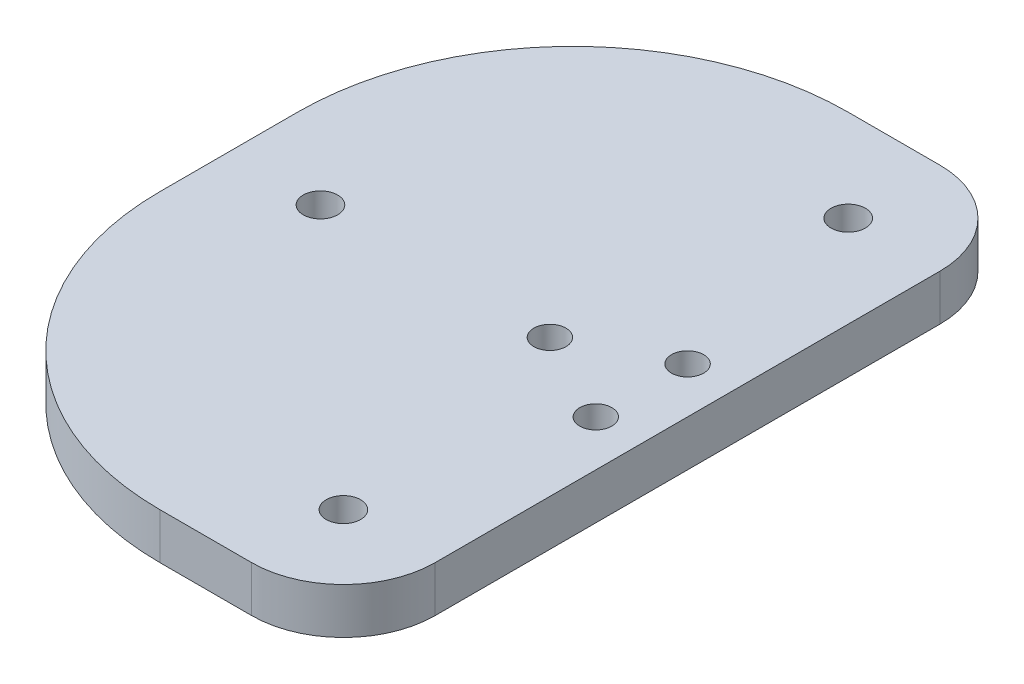
ISO-10303-21;
HEADER;
FILE_DESCRIPTION(('STEP AP214'),'2;1');
FILE_NAME('part.step','',(''),(''),'','','');
FILE_SCHEMA(('AUTOMOTIVE_DESIGN { 1 0 10303 214 1 1 1 1 }'));
ENDSEC;
DATA;
#1=APPLICATION_CONTEXT('core data for automotive mechanical design processes');
#2=APPLICATION_PROTOCOL_DEFINITION('international standard','automotive_design',2000,#1);
#3=PRODUCT_CONTEXT('',#1,'mechanical');
#4=PRODUCT('Part','Part','',(#3));
#5=PRODUCT_RELATED_PRODUCT_CATEGORY('part','',(#4));
#6=PRODUCT_DEFINITION_FORMATION('','',#4);
#7=PRODUCT_DEFINITION_CONTEXT('part definition',#1,'design');
#8=PRODUCT_DEFINITION('design','',#6,#7);
#9=PRODUCT_DEFINITION_SHAPE('','',#8);
#10=(LENGTH_UNIT() NAMED_UNIT(*) SI_UNIT(.MILLI.,.METRE.));
#11=(NAMED_UNIT(*) PLANE_ANGLE_UNIT() SI_UNIT($,.RADIAN.));
#12=(NAMED_UNIT(*) SI_UNIT($,.STERADIAN.) SOLID_ANGLE_UNIT());
#13=UNCERTAINTY_MEASURE_WITH_UNIT(LENGTH_MEASURE(1.E-05),#10,'distance_accuracy_value','');
#14=(GEOMETRIC_REPRESENTATION_CONTEXT(3) GLOBAL_UNCERTAINTY_ASSIGNED_CONTEXT((#13)) GLOBAL_UNIT_ASSIGNED_CONTEXT((#10,
#11,#12)) REPRESENTATION_CONTEXT('',''));
#15=CARTESIAN_POINT('',(0.,0.,0.));
#16=DIRECTION('',(0.,0.,1.));
#17=DIRECTION('',(1.,0.,0.));
#18=AXIS2_PLACEMENT_3D('',#15,#16,#17);
#19=CARTESIAN_POINT('',(45.,5.,-32.5));
#20=DIRECTION('',(0.,-1.,0.));
#21=DIRECTION('',(0.,0.,-1.));
#22=AXIS2_PLACEMENT_3D('',#19,#20,#21);
#23=CYLINDRICAL_SURFACE('',#22,1.75);
#24=CARTESIAN_POINT('',(45.,5.,-32.5));
#25=DIRECTION('',(0.,1.,0.));
#26=DIRECTION('',(0.,0.,1.));
#27=AXIS2_PLACEMENT_3D('',#24,#25,#26);
#28=CIRCLE('',#27,1.75);
#29=CARTESIAN_POINT('',(45.,5.,-30.75));
#30=VERTEX_POINT('',#29);
#31=EDGE_CURVE('E215',#30,#30,#28,.T.);
#32=ORIENTED_EDGE('',*,*,#31,.T.);
#33=EDGE_LOOP('',(#32));
#34=FACE_BOUND('',#33,.T.);
#35=CARTESIAN_POINT('',(45.,2.5,-32.5));
#36=DIRECTION('',(0.,-1.,0.));
#37=DIRECTION('',(0.,0.,-1.));
#38=AXIS2_PLACEMENT_3D('',#35,#36,#37);
#39=CIRCLE('',#38,1.75);
#40=CARTESIAN_POINT('',(45.,2.5,-34.25));
#41=VERTEX_POINT('',#40);
#42=EDGE_CURVE('E152',#41,#41,#39,.T.);
#43=ORIENTED_EDGE('',*,*,#42,.T.);
#44=EDGE_LOOP('',(#43));
#45=FACE_BOUND('',#44,.T.);
#46=ADVANCED_FACE('F37',(#34,#45),#23,.F.);
#47=CARTESIAN_POINT('',(35.,5.,-37.5));
#48=DIRECTION('',(0.,-1.,0.));
#49=DIRECTION('',(0.,0.,-1.));
#50=AXIS2_PLACEMENT_3D('',#47,#48,#49);
#51=CYLINDRICAL_SURFACE('',#50,1.75);
#52=CARTESIAN_POINT('',(35.,5.,-37.5));
#53=DIRECTION('',(0.,1.,0.));
#54=DIRECTION('',(0.,0.,1.));
#55=AXIS2_PLACEMENT_3D('',#52,#53,#54);
#56=CIRCLE('',#55,1.75);
#57=CARTESIAN_POINT('',(35.,5.,-35.75));
#58=VERTEX_POINT('',#57);
#59=EDGE_CURVE('E220',#58,#58,#56,.T.);
#60=ORIENTED_EDGE('',*,*,#59,.T.);
#61=EDGE_LOOP('',(#60));
#62=FACE_BOUND('',#61,.T.);
#63=CARTESIAN_POINT('',(35.,2.5,-37.5));
#64=DIRECTION('',(0.,-1.,0.));
#65=DIRECTION('',(0.,0.,-1.));
#66=AXIS2_PLACEMENT_3D('',#63,#64,#65);
#67=CIRCLE('',#66,1.75);
#68=CARTESIAN_POINT('',(35.,2.5,-39.25));
#69=VERTEX_POINT('',#68);
#70=EDGE_CURVE('E148',#69,#69,#67,.T.);
#71=ORIENTED_EDGE('',*,*,#70,.T.);
#72=EDGE_LOOP('',(#71));
#73=FACE_BOUND('',#72,.T.);
#74=ADVANCED_FACE('F270',(#62,#73),#51,.F.);
#75=CARTESIAN_POINT('',(45.,5.,-42.5));
#76=DIRECTION('',(0.,-1.,0.));
#77=DIRECTION('',(0.,0.,-1.));
#78=AXIS2_PLACEMENT_3D('',#75,#76,#77);
#79=CYLINDRICAL_SURFACE('',#78,1.75);
#80=CARTESIAN_POINT('',(45.,5.,-42.5));
#81=DIRECTION('',(0.,1.,0.));
#82=DIRECTION('',(0.,0.,1.));
#83=AXIS2_PLACEMENT_3D('',#80,#81,#82);
#84=CIRCLE('',#83,1.75);
#85=CARTESIAN_POINT('',(45.,5.,-40.75));
#86=VERTEX_POINT('',#85);
#87=EDGE_CURVE('E155',#86,#86,#84,.T.);
#88=ORIENTED_EDGE('',*,*,#87,.T.);
#89=EDGE_LOOP('',(#88));
#90=FACE_BOUND('',#89,.T.);
#91=CARTESIAN_POINT('',(45.,2.5,-42.5));
#92=DIRECTION('',(0.,-1.,0.));
#93=DIRECTION('',(0.,0.,-1.));
#94=AXIS2_PLACEMENT_3D('',#91,#92,#93);
#95=CIRCLE('',#94,1.75);
#96=CARTESIAN_POINT('',(45.,2.5,-44.25));
#97=VERTEX_POINT('',#96);
#98=EDGE_CURVE('E145',#97,#97,#95,.T.);
#99=ORIENTED_EDGE('',*,*,#98,.T.);
#100=EDGE_LOOP('',(#99));
#101=FACE_BOUND('',#100,.T.);
#102=ADVANCED_FACE('F276',(#90,#101),#79,.F.);
#103=CARTESIAN_POINT('',(0.,5.,0.));
#104=DIRECTION('',(0.,-1.,0.));
#105=DIRECTION('',(0.,0.,-1.));
#106=AXIS2_PLACEMENT_3D('',#103,#104,#105);
#107=PLANE('',#106);
#108=DIRECTION('',(0.,0.,-1.));
#109=VECTOR('',#108,1.);
#110=CARTESIAN_POINT('',(50.,5.,0.));
#111=LINE('',#110,#109);
#112=CARTESIAN_POINT('',(50.,5.,-10.));
#113=VERTEX_POINT('',#112);
#114=CARTESIAN_POINT('',(50.,5.,-65.));
#115=VERTEX_POINT('',#114);
#116=EDGE_CURVE('E183',#113,#115,#111,.T.);
#117=ORIENTED_EDGE('',*,*,#116,.T.);
#118=CARTESIAN_POINT('',(40.,5.,-65.));
#119=DIRECTION('',(0.,-1.,0.));
#120=DIRECTION('',(0.,0.,-1.));
#121=AXIS2_PLACEMENT_3D('',#118,#119,#120);
#122=CIRCLE('',#121,10.);
#123=CARTESIAN_POINT('',(40.,5.,-75.));
#124=VERTEX_POINT('',#123);
#125=EDGE_CURVE('E45',#115,#124,#122,.F.);
#126=ORIENTED_EDGE('',*,*,#125,.T.);
#127=DIRECTION('',(-1.,0.,0.));
#128=VECTOR('',#127,1.);
#129=CARTESIAN_POINT('',(0.,5.,-75.));
#130=LINE('',#129,#128);
#131=CARTESIAN_POINT('',(30.,5.,-75.));
#132=VERTEX_POINT('',#131);
#133=EDGE_CURVE('E139',#124,#132,#130,.T.);
#134=ORIENTED_EDGE('',*,*,#133,.T.);
#135=CARTESIAN_POINT('',(30.,5.,-45.));
#136=DIRECTION('',(0.,-1.,0.));
#137=DIRECTION('',(0.,0.,-1.));
#138=AXIS2_PLACEMENT_3D('',#135,#136,#137);
#139=CIRCLE('',#138,30.);
#140=CARTESIAN_POINT('',(0.,5.,-45.));
#141=VERTEX_POINT('',#140);
#142=EDGE_CURVE('E161',#132,#141,#139,.F.);
#143=ORIENTED_EDGE('',*,*,#142,.T.);
#144=DIRECTION('',(0.,0.,1.));
#145=VECTOR('',#144,1.);
#146=CARTESIAN_POINT('',(0.,5.,0.));
#147=LINE('',#146,#145);
#148=CARTESIAN_POINT('',(0.,5.,-30.));
#149=VERTEX_POINT('',#148);
#150=EDGE_CURVE('E124',#141,#149,#147,.T.);
#151=ORIENTED_EDGE('',*,*,#150,.T.);
#152=CARTESIAN_POINT('',(30.,5.,-30.));
#153=DIRECTION('',(0.,-1.,0.));
#154=DIRECTION('',(0.,0.,-1.));
#155=AXIS2_PLACEMENT_3D('',#152,#153,#154);
#156=CIRCLE('',#155,30.);
#157=CARTESIAN_POINT('',(30.,5.,0.));
#158=VERTEX_POINT('',#157);
#159=EDGE_CURVE('E159',#149,#158,#156,.F.);
#160=ORIENTED_EDGE('',*,*,#159,.T.);
#161=DIRECTION('',(1.,0.,0.));
#162=VECTOR('',#161,1.);
#163=CARTESIAN_POINT('',(0.,5.,0.));
#164=LINE('',#163,#162);
#165=CARTESIAN_POINT('',(40.,5.,0.));
#166=VERTEX_POINT('',#165);
#167=EDGE_CURVE('E196',#158,#166,#164,.T.);
#168=ORIENTED_EDGE('',*,*,#167,.T.);
#169=CARTESIAN_POINT('',(40.,5.,-10.));
#170=DIRECTION('',(0.,-1.,0.));
#171=DIRECTION('',(0.,0.,-1.));
#172=AXIS2_PLACEMENT_3D('',#169,#170,#171);
#173=CIRCLE('',#172,10.);
#174=EDGE_CURVE('E177',#166,#113,#173,.F.);
#175=ORIENTED_EDGE('',*,*,#174,.T.);
#176=EDGE_LOOP('',(#117,#126,#134,#143,#151,#160,#168,#175));
#177=FACE_BOUND('',#176,.T.);
#178=CARTESIAN_POINT('',(40.,5.,-65.));
#179=DIRECTION('',(0.,1.,0.));
#180=DIRECTION('',(0.,0.,1.));
#181=AXIS2_PLACEMENT_3D('',#178,#179,#180);
#182=CIRCLE('',#181,1.875);
#183=CARTESIAN_POINT('',(40.,5.,-63.125));
#184=VERTEX_POINT('',#183);
#185=EDGE_CURVE('E131',#184,#184,#182,.T.);
#186=ORIENTED_EDGE('',*,*,#185,.F.);
#187=EDGE_LOOP('',(#186));
#188=FACE_BOUND('',#187,.T.);
#189=CARTESIAN_POINT('',(40.,5.,-9.99999999999999));
#190=DIRECTION('',(0.,1.,0.));
#191=DIRECTION('',(0.,0.,1.));
#192=AXIS2_PLACEMENT_3D('',#189,#190,#191);
#193=CIRCLE('',#192,1.875);
#194=CARTESIAN_POINT('',(40.,5.,-8.12499999999999));
#195=VERTEX_POINT('',#194);
#196=EDGE_CURVE('E204',#195,#195,#193,.T.);
#197=ORIENTED_EDGE('',*,*,#196,.F.);
#198=EDGE_LOOP('',(#197));
#199=FACE_BOUND('',#198,.T.);
#200=CARTESIAN_POINT('',(10.,5.,-37.5));
#201=DIRECTION('',(0.,1.,0.));
#202=DIRECTION('',(0.,0.,1.));
#203=AXIS2_PLACEMENT_3D('',#200,#201,#202);
#204=CIRCLE('',#203,1.875);
#205=CARTESIAN_POINT('',(10.,5.,-35.625));
#206=VERTEX_POINT('',#205);
#207=EDGE_CURVE('E209',#206,#206,#204,.T.);
#208=ORIENTED_EDGE('',*,*,#207,.F.);
#209=EDGE_LOOP('',(#208));
#210=FACE_BOUND('',#209,.T.);
#211=ORIENTED_EDGE('',*,*,#31,.F.);
#212=EDGE_LOOP('',(#211));
#213=FACE_BOUND('',#212,.T.);
#214=ORIENTED_EDGE('',*,*,#59,.F.);
#215=EDGE_LOOP('',(#214));
#216=FACE_BOUND('',#215,.T.);
#217=ORIENTED_EDGE('',*,*,#87,.F.);
#218=EDGE_LOOP('',(#217));
#219=FACE_BOUND('',#218,.T.);
#220=ADVANCED_FACE('F181',(#177,#188,#199,#210,#213,#216,#219),#107,.F.);
#221=CARTESIAN_POINT('',(0.,0.,0.));
#222=DIRECTION('',(0.,-1.,0.));
#223=DIRECTION('',(0.,0.,-1.));
#224=AXIS2_PLACEMENT_3D('',#221,#222,#223);
#225=PLANE('',#224);
#226=CARTESIAN_POINT('',(35.,0.,-37.5));
#227=DIRECTION('',(0.,-1.,0.));
#228=DIRECTION('',(0.,0.,-1.));
#229=AXIS2_PLACEMENT_3D('',#226,#227,#228);
#230=CIRCLE('',#229,3.);
#231=CARTESIAN_POINT('',(35.,0.,-40.5));
#232=VERTEX_POINT('',#231);
#233=EDGE_CURVE('E234',#232,#232,#230,.T.);
#234=ORIENTED_EDGE('',*,*,#233,.F.);
#235=EDGE_LOOP('',(#234));
#236=FACE_BOUND('',#235,.T.);
#237=CARTESIAN_POINT('',(45.,0.,-42.5));
#238=DIRECTION('',(0.,-1.,0.));
#239=DIRECTION('',(0.,0.,-1.));
#240=AXIS2_PLACEMENT_3D('',#237,#238,#239);
#241=CIRCLE('',#240,3.);
#242=CARTESIAN_POINT('',(45.,0.,-45.5));
#243=VERTEX_POINT('',#242);
#244=EDGE_CURVE('E228',#243,#243,#241,.T.);
#245=ORIENTED_EDGE('',*,*,#244,.F.);
#246=EDGE_LOOP('',(#245));
#247=FACE_BOUND('',#246,.T.);
#248=CARTESIAN_POINT('',(45.,0.,-32.5));
#249=DIRECTION('',(0.,-1.,0.));
#250=DIRECTION('',(0.,0.,-1.));
#251=AXIS2_PLACEMENT_3D('',#248,#249,#250);
#252=CIRCLE('',#251,3.);
#253=CARTESIAN_POINT('',(45.,0.,-35.5));
#254=VERTEX_POINT('',#253);
#255=EDGE_CURVE('E225',#254,#254,#252,.T.);
#256=ORIENTED_EDGE('',*,*,#255,.F.);
#257=EDGE_LOOP('',(#256));
#258=FACE_BOUND('',#257,.T.);
#259=CARTESIAN_POINT('',(10.,0.,-37.5));
#260=DIRECTION('',(0.,1.,0.));
#261=DIRECTION('',(0.,0.,1.));
#262=AXIS2_PLACEMENT_3D('',#259,#260,#261);
#263=CIRCLE('',#262,1.875);
#264=CARTESIAN_POINT('',(10.,0.,-35.625));
#265=VERTEX_POINT('',#264);
#266=EDGE_CURVE('E212',#265,#265,#263,.T.);
#267=ORIENTED_EDGE('',*,*,#266,.T.);
#268=EDGE_LOOP('',(#267));
#269=FACE_BOUND('',#268,.T.);
#270=CARTESIAN_POINT('',(40.,0.,-65.));
#271=DIRECTION('',(0.,1.,0.));
#272=DIRECTION('',(0.,0.,1.));
#273=AXIS2_PLACEMENT_3D('',#270,#271,#272);
#274=CIRCLE('',#273,1.875);
#275=CARTESIAN_POINT('',(40.,0.,-63.125));
#276=VERTEX_POINT('',#275);
#277=EDGE_CURVE('E136',#276,#276,#274,.T.);
#278=ORIENTED_EDGE('',*,*,#277,.T.);
#279=EDGE_LOOP('',(#278));
#280=FACE_BOUND('',#279,.T.);
#281=DIRECTION('',(-1.,0.,0.));
#282=VECTOR('',#281,1.);
#283=CARTESIAN_POINT('',(0.,0.,-75.));
#284=LINE('',#283,#282);
#285=CARTESIAN_POINT('',(40.,0.,-75.));
#286=VERTEX_POINT('',#285);
#287=CARTESIAN_POINT('',(30.,0.,-75.));
#288=VERTEX_POINT('',#287);
#289=EDGE_CURVE('E143',#286,#288,#284,.T.);
#290=ORIENTED_EDGE('',*,*,#289,.F.);
#291=CARTESIAN_POINT('',(40.,0.,-65.));
#292=DIRECTION('',(0.,-1.,0.));
#293=DIRECTION('',(0.,0.,-1.));
#294=AXIS2_PLACEMENT_3D('',#291,#292,#293);
#295=CIRCLE('',#294,10.);
#296=CARTESIAN_POINT('',(50.,0.,-65.));
#297=VERTEX_POINT('',#296);
#298=EDGE_CURVE('E171',#286,#297,#295,.T.);
#299=ORIENTED_EDGE('',*,*,#298,.T.);
#300=DIRECTION('',(0.,0.,-1.));
#301=VECTOR('',#300,1.);
#302=CARTESIAN_POINT('',(50.,0.,0.));
#303=LINE('',#302,#301);
#304=CARTESIAN_POINT('',(50.,0.,-10.));
#305=VERTEX_POINT('',#304);
#306=EDGE_CURVE('E133',#305,#297,#303,.T.);
#307=ORIENTED_EDGE('',*,*,#306,.F.);
#308=CARTESIAN_POINT('',(40.,0.,-10.));
#309=DIRECTION('',(0.,-1.,0.));
#310=DIRECTION('',(0.,0.,-1.));
#311=AXIS2_PLACEMENT_3D('',#308,#309,#310);
#312=CIRCLE('',#311,10.);
#313=CARTESIAN_POINT('',(40.,0.,0.));
#314=VERTEX_POINT('',#313);
#315=EDGE_CURVE('E169',#305,#314,#312,.T.);
#316=ORIENTED_EDGE('',*,*,#315,.T.);
#317=DIRECTION('',(1.,0.,0.));
#318=VECTOR('',#317,1.);
#319=CARTESIAN_POINT('',(0.,0.,0.));
#320=LINE('',#319,#318);
#321=CARTESIAN_POINT('',(30.,0.,0.));
#322=VERTEX_POINT('',#321);
#323=EDGE_CURVE('E130',#322,#314,#320,.T.);
#324=ORIENTED_EDGE('',*,*,#323,.F.);
#325=CARTESIAN_POINT('',(30.,0.,-30.));
#326=DIRECTION('',(0.,-1.,0.));
#327=DIRECTION('',(0.,0.,-1.));
#328=AXIS2_PLACEMENT_3D('',#325,#326,#327);
#329=CIRCLE('',#328,30.);
#330=CARTESIAN_POINT('',(0.,0.,-30.));
#331=VERTEX_POINT('',#330);
#332=EDGE_CURVE('E115',#322,#331,#329,.T.);
#333=ORIENTED_EDGE('',*,*,#332,.T.);
#334=DIRECTION('',(0.,0.,1.));
#335=VECTOR('',#334,1.);
#336=CARTESIAN_POINT('',(0.,0.,0.));
#337=LINE('',#336,#335);
#338=CARTESIAN_POINT('',(0.,0.,-45.));
#339=VERTEX_POINT('',#338);
#340=EDGE_CURVE('E121',#339,#331,#337,.T.);
#341=ORIENTED_EDGE('',*,*,#340,.F.);
#342=CARTESIAN_POINT('',(30.,0.,-45.));
#343=DIRECTION('',(0.,-1.,0.));
#344=DIRECTION('',(0.,0.,-1.));
#345=AXIS2_PLACEMENT_3D('',#342,#343,#344);
#346=CIRCLE('',#345,30.);
#347=EDGE_CURVE('E105',#339,#288,#346,.T.);
#348=ORIENTED_EDGE('',*,*,#347,.T.);
#349=EDGE_LOOP('',(#290,#299,#307,#316,#324,#333,#341,#348));
#350=FACE_BOUND('',#349,.T.);
#351=CARTESIAN_POINT('',(40.,0.,-9.99999999999999));
#352=DIRECTION('',(0.,1.,0.));
#353=DIRECTION('',(0.,0.,1.));
#354=AXIS2_PLACEMENT_3D('',#351,#352,#353);
#355=CIRCLE('',#354,1.875);
#356=CARTESIAN_POINT('',(40.,0.,-8.12499999999999));
#357=VERTEX_POINT('',#356);
#358=EDGE_CURVE('E206',#357,#357,#355,.T.);
#359=ORIENTED_EDGE('',*,*,#358,.T.);
#360=EDGE_LOOP('',(#359));
#361=FACE_BOUND('',#360,.T.);
#362=ADVANCED_FACE('F127',(#236,#247,#258,#269,#280,#350,#361),#225,.T.);
#363=CARTESIAN_POINT('',(0.,5.,0.));
#364=DIRECTION('',(1.,0.,0.));
#365=DIRECTION('',(0.,0.,-1.));
#366=AXIS2_PLACEMENT_3D('',#363,#364,#365);
#367=PLANE('',#366);
#368=ORIENTED_EDGE('',*,*,#150,.F.);
#369=DIRECTION('',(0.,-1.,0.));
#370=VECTOR('',#369,1.);
#371=CARTESIAN_POINT('',(0.,5.,-45.));
#372=LINE('',#371,#370);
#373=EDGE_CURVE('E109',#141,#339,#372,.T.);
#374=ORIENTED_EDGE('',*,*,#373,.T.);
#375=ORIENTED_EDGE('',*,*,#340,.T.);
#376=DIRECTION('',(0.,-1.,0.));
#377=VECTOR('',#376,1.);
#378=CARTESIAN_POINT('',(0.,5.,-30.));
#379=LINE('',#378,#377);
#380=EDGE_CURVE('E125',#331,#149,#379,.F.);
#381=ORIENTED_EDGE('',*,*,#380,.T.);
#382=EDGE_LOOP('',(#368,#374,#375,#381));
#383=FACE_BOUND('',#382,.T.);
#384=ADVANCED_FACE('F120',(#383),#367,.F.);
#385=CARTESIAN_POINT('',(0.,5.,0.));
#386=DIRECTION('',(0.,0.,-1.));
#387=DIRECTION('',(-1.,0.,0.));
#388=AXIS2_PLACEMENT_3D('',#385,#386,#387);
#389=PLANE('',#388);
#390=ORIENTED_EDGE('',*,*,#323,.T.);
#391=DIRECTION('',(0.,-1.,0.));
#392=VECTOR('',#391,1.);
#393=CARTESIAN_POINT('',(40.,5.,0.));
#394=LINE('',#393,#392);
#395=EDGE_CURVE('E11',#314,#166,#394,.F.);
#396=ORIENTED_EDGE('',*,*,#395,.T.);
#397=ORIENTED_EDGE('',*,*,#167,.F.);
#398=DIRECTION('',(0.,-1.,0.));
#399=VECTOR('',#398,1.);
#400=CARTESIAN_POINT('',(30.,5.,0.));
#401=LINE('',#400,#399);
#402=EDGE_CURVE('E163',#158,#322,#401,.T.);
#403=ORIENTED_EDGE('',*,*,#402,.T.);
#404=EDGE_LOOP('',(#390,#396,#397,#403));
#405=FACE_BOUND('',#404,.T.);
#406=ADVANCED_FACE('F194',(#405),#389,.F.);
#407=CARTESIAN_POINT('',(50.,5.,0.));
#408=DIRECTION('',(-1.,0.,0.));
#409=DIRECTION('',(0.,0.,1.));
#410=AXIS2_PLACEMENT_3D('',#407,#408,#409);
#411=PLANE('',#410);
#412=ORIENTED_EDGE('',*,*,#306,.T.);
#413=DIRECTION('',(0.,-1.,0.));
#414=VECTOR('',#413,1.);
#415=CARTESIAN_POINT('',(50.,5.,-65.));
#416=LINE('',#415,#414);
#417=EDGE_CURVE('E58',#297,#115,#416,.F.);
#418=ORIENTED_EDGE('',*,*,#417,.T.);
#419=ORIENTED_EDGE('',*,*,#116,.F.);
#420=DIRECTION('',(0.,-1.,0.));
#421=VECTOR('',#420,1.);
#422=CARTESIAN_POINT('',(50.,5.,-10.));
#423=LINE('',#422,#421);
#424=EDGE_CURVE('E173',#113,#305,#423,.T.);
#425=ORIENTED_EDGE('',*,*,#424,.T.);
#426=EDGE_LOOP('',(#412,#418,#419,#425));
#427=FACE_BOUND('',#426,.T.);
#428=ADVANCED_FACE('F190',(#427),#411,.F.);
#429=CARTESIAN_POINT('',(0.,5.,-75.));
#430=DIRECTION('',(0.,0.,1.));
#431=DIRECTION('',(1.,0.,0.));
#432=AXIS2_PLACEMENT_3D('',#429,#430,#431);
#433=PLANE('',#432);
#434=ORIENTED_EDGE('',*,*,#133,.F.);
#435=DIRECTION('',(0.,-1.,0.));
#436=VECTOR('',#435,1.);
#437=CARTESIAN_POINT('',(40.,5.,-75.));
#438=LINE('',#437,#436);
#439=EDGE_CURVE('E166',#124,#286,#438,.T.);
#440=ORIENTED_EDGE('',*,*,#439,.T.);
#441=ORIENTED_EDGE('',*,*,#289,.T.);
#442=DIRECTION('',(0.,-1.,0.));
#443=VECTOR('',#442,1.);
#444=CARTESIAN_POINT('',(30.,5.,-75.));
#445=LINE('',#444,#443);
#446=EDGE_CURVE('E111',#288,#132,#445,.F.);
#447=ORIENTED_EDGE('',*,*,#446,.T.);
#448=EDGE_LOOP('',(#434,#440,#441,#447));
#449=FACE_BOUND('',#448,.T.);
#450=ADVANCED_FACE('F187',(#449),#433,.F.);
#451=CARTESIAN_POINT('',(40.,5.,-65.));
#452=DIRECTION('',(0.,-1.,0.));
#453=DIRECTION('',(0.,0.,-1.));
#454=AXIS2_PLACEMENT_3D('',#451,#452,#453);
#455=CYLINDRICAL_SURFACE('',#454,1.875);
#456=ORIENTED_EDGE('',*,*,#185,.T.);
#457=EDGE_LOOP('',(#456));
#458=FACE_BOUND('',#457,.T.);
#459=ORIENTED_EDGE('',*,*,#277,.F.);
#460=EDGE_LOOP('',(#459));
#461=FACE_BOUND('',#460,.T.);
#462=ADVANCED_FACE('F255',(#458,#461),#455,.F.);
#463=CARTESIAN_POINT('',(40.,5.,-9.99999999999999));
#464=DIRECTION('',(0.,-1.,0.));
#465=DIRECTION('',(0.,0.,-1.));
#466=AXIS2_PLACEMENT_3D('',#463,#464,#465);
#467=CYLINDRICAL_SURFACE('',#466,1.875);
#468=ORIENTED_EDGE('',*,*,#196,.T.);
#469=EDGE_LOOP('',(#468));
#470=FACE_BOUND('',#469,.T.);
#471=ORIENTED_EDGE('',*,*,#358,.F.);
#472=EDGE_LOOP('',(#471));
#473=FACE_BOUND('',#472,.T.);
#474=ADVANCED_FACE('F257',(#470,#473),#467,.F.);
#475=CARTESIAN_POINT('',(10.,5.,-37.5));
#476=DIRECTION('',(0.,-1.,0.));
#477=DIRECTION('',(0.,0.,-1.));
#478=AXIS2_PLACEMENT_3D('',#475,#476,#477);
#479=CYLINDRICAL_SURFACE('',#478,1.875);
#480=ORIENTED_EDGE('',*,*,#207,.T.);
#481=EDGE_LOOP('',(#480));
#482=FACE_BOUND('',#481,.T.);
#483=ORIENTED_EDGE('',*,*,#266,.F.);
#484=EDGE_LOOP('',(#483));
#485=FACE_BOUND('',#484,.T.);
#486=ADVANCED_FACE('F264',(#482,#485),#479,.F.);
#487=CARTESIAN_POINT('',(45.,2.5,-42.5));
#488=DIRECTION('',(0.,-1.,0.));
#489=DIRECTION('',(0.,0.,-1.));
#490=AXIS2_PLACEMENT_3D('',#487,#488,#489);
#491=CYLINDRICAL_SURFACE('',#490,3.);
#492=CARTESIAN_POINT('',(45.,2.5,-42.5));
#493=DIRECTION('',(0.,-1.,0.));
#494=DIRECTION('',(0.,0.,-1.));
#495=AXIS2_PLACEMENT_3D('',#492,#493,#494);
#496=CIRCLE('',#495,3.);
#497=CARTESIAN_POINT('',(45.,2.5,-45.5));
#498=VERTEX_POINT('',#497);
#499=EDGE_CURVE('E237',#498,#498,#496,.T.);
#500=ORIENTED_EDGE('',*,*,#499,.F.);
#501=EDGE_LOOP('',(#500));
#502=FACE_BOUND('',#501,.T.);
#503=ORIENTED_EDGE('',*,*,#244,.T.);
#504=EDGE_LOOP('',(#503));
#505=FACE_BOUND('',#504,.T.);
#506=ADVANCED_FACE('F243',(#502,#505),#491,.F.);
#507=CARTESIAN_POINT('',(45.,2.5,-42.5));
#508=DIRECTION('',(0.,-1.,0.));
#509=DIRECTION('',(0.,0.,-1.));
#510=AXIS2_PLACEMENT_3D('',#507,#508,#509);
#511=PLANE('',#510);
#512=ORIENTED_EDGE('',*,*,#98,.F.);
#513=EDGE_LOOP('',(#512));
#514=FACE_BOUND('',#513,.T.);
#515=ORIENTED_EDGE('',*,*,#499,.T.);
#516=EDGE_LOOP('',(#515));
#517=FACE_BOUND('',#516,.T.);
#518=ADVANCED_FACE('F287',(#514,#517),#511,.T.);
#519=CARTESIAN_POINT('',(35.,2.5,-37.5));
#520=DIRECTION('',(0.,-1.,0.));
#521=DIRECTION('',(0.,0.,-1.));
#522=AXIS2_PLACEMENT_3D('',#519,#520,#521);
#523=CYLINDRICAL_SURFACE('',#522,3.);
#524=CARTESIAN_POINT('',(35.,2.5,-37.5));
#525=DIRECTION('',(0.,-1.,0.));
#526=DIRECTION('',(0.,0.,-1.));
#527=AXIS2_PLACEMENT_3D('',#524,#525,#526);
#528=CIRCLE('',#527,3.);
#529=CARTESIAN_POINT('',(35.,2.5,-40.5));
#530=VERTEX_POINT('',#529);
#531=EDGE_CURVE('E231',#530,#530,#528,.T.);
#532=ORIENTED_EDGE('',*,*,#531,.F.);
#533=EDGE_LOOP('',(#532));
#534=FACE_BOUND('',#533,.T.);
#535=ORIENTED_EDGE('',*,*,#233,.T.);
#536=EDGE_LOOP('',(#535));
#537=FACE_BOUND('',#536,.T.);
#538=ADVANCED_FACE('F307',(#534,#537),#523,.F.);
#539=CARTESIAN_POINT('',(35.,2.5,-37.5));
#540=DIRECTION('',(0.,-1.,0.));
#541=DIRECTION('',(0.,0.,-1.));
#542=AXIS2_PLACEMENT_3D('',#539,#540,#541);
#543=PLANE('',#542);
#544=ORIENTED_EDGE('',*,*,#70,.F.);
#545=EDGE_LOOP('',(#544));
#546=FACE_BOUND('',#545,.T.);
#547=ORIENTED_EDGE('',*,*,#531,.T.);
#548=EDGE_LOOP('',(#547));
#549=FACE_BOUND('',#548,.T.);
#550=ADVANCED_FACE('F313',(#546,#549),#543,.T.);
#551=CARTESIAN_POINT('',(45.,2.5,-32.5));
#552=DIRECTION('',(0.,-1.,0.));
#553=DIRECTION('',(0.,0.,-1.));
#554=AXIS2_PLACEMENT_3D('',#551,#552,#553);
#555=CYLINDRICAL_SURFACE('',#554,3.);
#556=CARTESIAN_POINT('',(45.,2.5,-32.5));
#557=DIRECTION('',(0.,-1.,0.));
#558=DIRECTION('',(0.,0.,-1.));
#559=AXIS2_PLACEMENT_3D('',#556,#557,#558);
#560=CIRCLE('',#559,3.);
#561=CARTESIAN_POINT('',(45.,2.5,-35.5));
#562=VERTEX_POINT('',#561);
#563=EDGE_CURVE('E149',#562,#562,#560,.T.);
#564=ORIENTED_EDGE('',*,*,#563,.F.);
#565=EDGE_LOOP('',(#564));
#566=FACE_BOUND('',#565,.T.);
#567=ORIENTED_EDGE('',*,*,#255,.T.);
#568=EDGE_LOOP('',(#567));
#569=FACE_BOUND('',#568,.T.);
#570=ADVANCED_FACE('F319',(#566,#569),#555,.F.);
#571=CARTESIAN_POINT('',(45.,2.5,-32.5));
#572=DIRECTION('',(0.,-1.,0.));
#573=DIRECTION('',(0.,0.,-1.));
#574=AXIS2_PLACEMENT_3D('',#571,#572,#573);
#575=PLANE('',#574);
#576=ORIENTED_EDGE('',*,*,#42,.F.);
#577=EDGE_LOOP('',(#576));
#578=FACE_BOUND('',#577,.T.);
#579=ORIENTED_EDGE('',*,*,#563,.T.);
#580=EDGE_LOOP('',(#579));
#581=FACE_BOUND('',#580,.T.);
#582=ADVANCED_FACE('F321',(#578,#581),#575,.T.);
#583=CARTESIAN_POINT('',(30.,5.,-45.));
#584=DIRECTION('',(0.,-1.,0.));
#585=DIRECTION('',(0.,0.,-1.));
#586=AXIS2_PLACEMENT_3D('',#583,#584,#585);
#587=CYLINDRICAL_SURFACE('',#586,30.);
#588=ORIENTED_EDGE('',*,*,#142,.F.);
#589=ORIENTED_EDGE('',*,*,#446,.F.);
#590=ORIENTED_EDGE('',*,*,#347,.F.);
#591=ORIENTED_EDGE('',*,*,#373,.F.);
#592=EDGE_LOOP('',(#588,#589,#590,#591));
#593=FACE_BOUND('',#592,.T.);
#594=ADVANCED_FACE('F108',(#593),#587,.T.);
#595=CARTESIAN_POINT('',(30.,5.,-30.));
#596=DIRECTION('',(0.,-1.,0.));
#597=DIRECTION('',(0.,0.,-1.));
#598=AXIS2_PLACEMENT_3D('',#595,#596,#597);
#599=CYLINDRICAL_SURFACE('',#598,30.);
#600=ORIENTED_EDGE('',*,*,#159,.F.);
#601=ORIENTED_EDGE('',*,*,#380,.F.);
#602=ORIENTED_EDGE('',*,*,#332,.F.);
#603=ORIENTED_EDGE('',*,*,#402,.F.);
#604=EDGE_LOOP('',(#600,#601,#602,#603));
#605=FACE_BOUND('',#604,.T.);
#606=ADVANCED_FACE('F199',(#605),#599,.T.);
#607=CARTESIAN_POINT('',(40.,5.,-65.));
#608=DIRECTION('',(0.,-1.,0.));
#609=DIRECTION('',(0.,0.,-1.));
#610=AXIS2_PLACEMENT_3D('',#607,#608,#609);
#611=CYLINDRICAL_SURFACE('',#610,10.);
#612=ORIENTED_EDGE('',*,*,#125,.F.);
#613=ORIENTED_EDGE('',*,*,#417,.F.);
#614=ORIENTED_EDGE('',*,*,#298,.F.);
#615=ORIENTED_EDGE('',*,*,#439,.F.);
#616=EDGE_LOOP('',(#612,#613,#614,#615));
#617=FACE_BOUND('',#616,.T.);
#618=ADVANCED_FACE('F188',(#617),#611,.T.);
#619=CARTESIAN_POINT('',(40.,5.,-10.));
#620=DIRECTION('',(0.,-1.,0.));
#621=DIRECTION('',(0.,0.,-1.));
#622=AXIS2_PLACEMENT_3D('',#619,#620,#621);
#623=CYLINDRICAL_SURFACE('',#622,10.);
#624=ORIENTED_EDGE('',*,*,#174,.F.);
#625=ORIENTED_EDGE('',*,*,#395,.F.);
#626=ORIENTED_EDGE('',*,*,#315,.F.);
#627=ORIENTED_EDGE('',*,*,#424,.F.);
#628=EDGE_LOOP('',(#624,#625,#626,#627));
#629=FACE_BOUND('',#628,.T.);
#630=ADVANCED_FACE('F39',(#629),#623,.T.);
#631=CLOSED_SHELL('',(#46,#74,#102,#220,#362,#384,#406,#428,#450,#462,#474,#486,#506,#518,#538,
#550,#570,#582,#594,#606,#618,#630));
#632=MANIFOLD_SOLID_BREP('B2',#631);
#633=ADVANCED_BREP_SHAPE_REPRESENTATION('',(#18,#632),#14);
#634=SHAPE_DEFINITION_REPRESENTATION(#9,#633);
ENDSEC;
END-ISO-10303-21;
